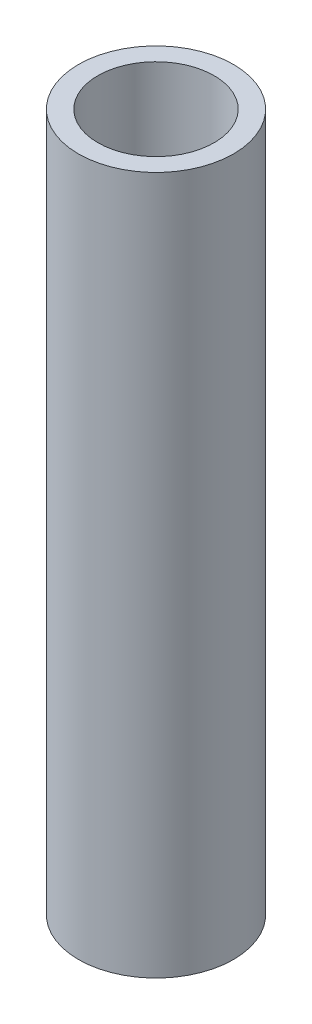
ISO-10303-21;
HEADER;
FILE_DESCRIPTION(('STEP AP214'),'2;1');
FILE_NAME('part.step','',(''),(''),'','','');
FILE_SCHEMA(('AUTOMOTIVE_DESIGN { 1 0 10303 214 1 1 1 1 }'));
ENDSEC;
DATA;
#1=APPLICATION_CONTEXT('core data for automotive mechanical design processes');
#2=APPLICATION_PROTOCOL_DEFINITION('international standard','automotive_design',2000,#1);
#3=PRODUCT_CONTEXT('',#1,'mechanical');
#4=PRODUCT('Part','Part','',(#3));
#5=PRODUCT_RELATED_PRODUCT_CATEGORY('part','',(#4));
#6=PRODUCT_DEFINITION_FORMATION('','',#4);
#7=PRODUCT_DEFINITION_CONTEXT('part definition',#1,'design');
#8=PRODUCT_DEFINITION('design','',#6,#7);
#9=PRODUCT_DEFINITION_SHAPE('','',#8);
#10=(LENGTH_UNIT() NAMED_UNIT(*) SI_UNIT(.MILLI.,.METRE.));
#11=(NAMED_UNIT(*) PLANE_ANGLE_UNIT() SI_UNIT($,.RADIAN.));
#12=(NAMED_UNIT(*) SI_UNIT($,.STERADIAN.) SOLID_ANGLE_UNIT());
#13=UNCERTAINTY_MEASURE_WITH_UNIT(LENGTH_MEASURE(1.E-05),#10,'distance_accuracy_value','');
#14=(GEOMETRIC_REPRESENTATION_CONTEXT(3) GLOBAL_UNCERTAINTY_ASSIGNED_CONTEXT((#13)) GLOBAL_UNIT_ASSIGNED_CONTEXT((#10,
#11,#12)) REPRESENTATION_CONTEXT('',''));
#15=CARTESIAN_POINT('',(0.,0.,0.));
#16=DIRECTION('',(0.,0.,1.));
#17=DIRECTION('',(1.,0.,0.));
#18=AXIS2_PLACEMENT_3D('',#15,#16,#17);
#19=CARTESIAN_POINT('',(0.,114.3,0.));
#20=DIRECTION('',(0.,1.,0.));
#21=DIRECTION('',(0.,0.,1.));
#22=AXIS2_PLACEMENT_3D('',#19,#20,#21);
#23=PLANE('',#22);
#24=CARTESIAN_POINT('',(0.,114.3,0.));
#25=DIRECTION('',(0.,1.,0.));
#26=DIRECTION('',(0.,0.,1.));
#27=AXIS2_PLACEMENT_3D('',#24,#25,#26);
#28=CIRCLE('',#27,12.7);
#29=CARTESIAN_POINT('',(0.,114.3,12.7));
#30=VERTEX_POINT('',#29);
#31=EDGE_CURVE('E10',#30,#30,#28,.T.);
#32=ORIENTED_EDGE('',*,*,#31,.T.);
#33=EDGE_LOOP('',(#32));
#34=FACE_BOUND('',#33,.T.);
#35=CARTESIAN_POINT('',(0.,114.3,0.));
#36=DIRECTION('',(0.,1.,0.));
#37=DIRECTION('',(0.,0.,1.));
#38=AXIS2_PLACEMENT_3D('',#35,#36,#37);
#39=CIRCLE('',#38,9.52500000000002);
#40=CARTESIAN_POINT('',(0.,114.3,9.52500000000002));
#41=VERTEX_POINT('',#40);
#42=EDGE_CURVE('E42',#41,#41,#39,.T.);
#43=ORIENTED_EDGE('',*,*,#42,.F.);
#44=EDGE_LOOP('',(#43));
#45=FACE_BOUND('',#44,.T.);
#46=ADVANCED_FACE('F31',(#34,#45),#23,.T.);
#47=CARTESIAN_POINT('',(0.,0.,0.));
#48=DIRECTION('',(0.,1.,0.));
#49=DIRECTION('',(0.,0.,1.));
#50=AXIS2_PLACEMENT_3D('',#47,#48,#49);
#51=PLANE('',#50);
#52=CARTESIAN_POINT('',(0.,0.,0.));
#53=DIRECTION('',(0.,1.,0.));
#54=DIRECTION('',(0.,0.,1.));
#55=AXIS2_PLACEMENT_3D('',#52,#53,#54);
#56=CIRCLE('',#55,12.7);
#57=CARTESIAN_POINT('',(0.,0.,12.7));
#58=VERTEX_POINT('',#57);
#59=EDGE_CURVE('E35',#58,#58,#56,.T.);
#60=ORIENTED_EDGE('',*,*,#59,.F.);
#61=EDGE_LOOP('',(#60));
#62=FACE_BOUND('',#61,.T.);
#63=CARTESIAN_POINT('',(0.,0.,0.));
#64=DIRECTION('',(0.,1.,0.));
#65=DIRECTION('',(0.,0.,1.));
#66=AXIS2_PLACEMENT_3D('',#63,#64,#65);
#67=CIRCLE('',#66,9.52500000000002);
#68=CARTESIAN_POINT('',(0.,0.,9.52500000000002));
#69=VERTEX_POINT('',#68);
#70=EDGE_CURVE('E44',#69,#69,#67,.T.);
#71=ORIENTED_EDGE('',*,*,#70,.T.);
#72=EDGE_LOOP('',(#71));
#73=FACE_BOUND('',#72,.T.);
#74=ADVANCED_FACE('F54',(#62,#73),#51,.F.);
#75=CARTESIAN_POINT('',(0.,114.3,0.));
#76=DIRECTION('',(0.,-1.,0.));
#77=DIRECTION('',(0.,0.,-1.));
#78=AXIS2_PLACEMENT_3D('',#75,#76,#77);
#79=CYLINDRICAL_SURFACE('',#78,12.7);
#80=ORIENTED_EDGE('',*,*,#31,.F.);
#81=EDGE_LOOP('',(#80));
#82=FACE_BOUND('',#81,.T.);
#83=ORIENTED_EDGE('',*,*,#59,.T.);
#84=EDGE_LOOP('',(#83));
#85=FACE_BOUND('',#84,.T.);
#86=ADVANCED_FACE('F33',(#82,#85),#79,.T.);
#87=CARTESIAN_POINT('',(0.,114.3,0.));
#88=DIRECTION('',(0.,-1.,0.));
#89=DIRECTION('',(0.,0.,-1.));
#90=AXIS2_PLACEMENT_3D('',#87,#88,#89);
#91=CYLINDRICAL_SURFACE('',#90,9.52500000000002);
#92=ORIENTED_EDGE('',*,*,#42,.T.);
#93=EDGE_LOOP('',(#92));
#94=FACE_BOUND('',#93,.T.);
#95=ORIENTED_EDGE('',*,*,#70,.F.);
#96=EDGE_LOOP('',(#95));
#97=FACE_BOUND('',#96,.T.);
#98=ADVANCED_FACE('F50',(#94,#97),#91,.F.);
#99=CLOSED_SHELL('',(#46,#74,#86,#98));
#100=MANIFOLD_SOLID_BREP('B2',#99);
#101=ADVANCED_BREP_SHAPE_REPRESENTATION('',(#18,#100),#14);
#102=SHAPE_DEFINITION_REPRESENTATION(#9,#101);
ENDSEC;
END-ISO-10303-21;
